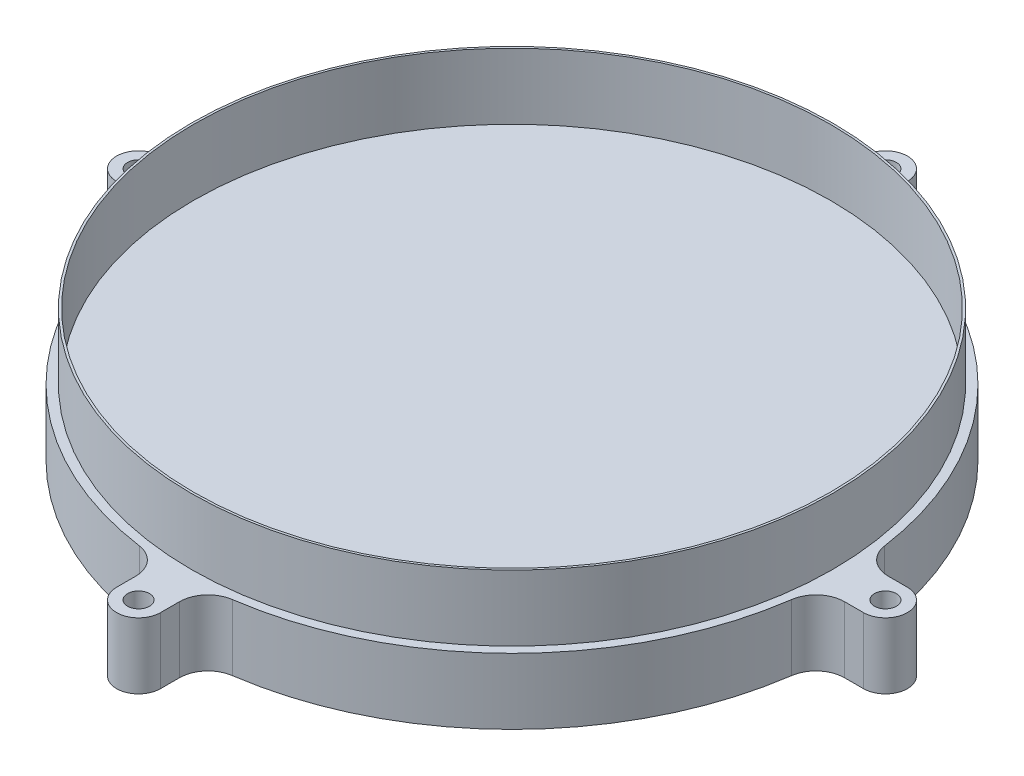
ISO-10303-21;
HEADER;
FILE_DESCRIPTION(('STEP AP214'),'2;1');
FILE_NAME('part.step','',(''),(''),'','','');
FILE_SCHEMA(('AUTOMOTIVE_DESIGN { 1 0 10303 214 1 1 1 1 }'));
ENDSEC;
DATA;
#1=APPLICATION_CONTEXT('core data for automotive mechanical design processes');
#2=APPLICATION_PROTOCOL_DEFINITION('international standard','automotive_design',2000,#1);
#3=PRODUCT_CONTEXT('',#1,'mechanical');
#4=PRODUCT('Part','Part','',(#3));
#5=PRODUCT_RELATED_PRODUCT_CATEGORY('part','',(#4));
#6=PRODUCT_DEFINITION_FORMATION('','',#4);
#7=PRODUCT_DEFINITION_CONTEXT('part definition',#1,'design');
#8=PRODUCT_DEFINITION('design','',#6,#7);
#9=PRODUCT_DEFINITION_SHAPE('','',#8);
#10=(LENGTH_UNIT() NAMED_UNIT(*) SI_UNIT(.MILLI.,.METRE.));
#11=(NAMED_UNIT(*) PLANE_ANGLE_UNIT() SI_UNIT($,.RADIAN.));
#12=(NAMED_UNIT(*) SI_UNIT($,.STERADIAN.) SOLID_ANGLE_UNIT());
#13=UNCERTAINTY_MEASURE_WITH_UNIT(LENGTH_MEASURE(1.E-05),#10,'distance_accuracy_value','');
#14=(GEOMETRIC_REPRESENTATION_CONTEXT(3) GLOBAL_UNCERTAINTY_ASSIGNED_CONTEXT((#13)) GLOBAL_UNIT_ASSIGNED_CONTEXT((#10,
#11,#12)) REPRESENTATION_CONTEXT('',''));
#15=CARTESIAN_POINT('',(0.,0.,0.));
#16=DIRECTION('',(0.,0.,1.));
#17=DIRECTION('',(1.,0.,0.));
#18=AXIS2_PLACEMENT_3D('',#15,#16,#17);
#19=CARTESIAN_POINT('',(0.,30.,0.));
#20=DIRECTION('',(0.,1.,0.));
#21=DIRECTION('',(0.,0.,1.));
#22=AXIS2_PLACEMENT_3D('',#19,#20,#21);
#23=PLANE('',#22);
#24=CARTESIAN_POINT('',(0.,30.,0.));
#25=DIRECTION('',(0.,1.,0.));
#26=DIRECTION('',(0.,0.,1.));
#27=AXIS2_PLACEMENT_3D('',#24,#25,#26);
#28=CIRCLE('',#27,146.);
#29=CARTESIAN_POINT('',(0.,30.,146.));
#30=VERTEX_POINT('',#29);
#31=EDGE_CURVE('E12',#30,#30,#28,.T.);
#32=ORIENTED_EDGE('',*,*,#31,.T.);
#33=EDGE_LOOP('',(#32));
#34=FACE_BOUND('',#33,.T.);
#35=CARTESIAN_POINT('',(0.,30.,0.));
#36=DIRECTION('',(0.,1.,0.));
#37=DIRECTION('',(0.,0.,1.));
#38=AXIS2_PLACEMENT_3D('',#35,#36,#37);
#39=CIRCLE('',#38,145.);
#40=CARTESIAN_POINT('',(0.,30.,145.));
#41=VERTEX_POINT('',#40);
#42=EDGE_CURVE('E50',#41,#41,#39,.T.);
#43=ORIENTED_EDGE('',*,*,#42,.F.);
#44=EDGE_LOOP('',(#43));
#45=FACE_BOUND('',#44,.T.);
#46=ADVANCED_FACE('F41',(#34,#45),#23,.T.);
#47=CARTESIAN_POINT('',(0.,30.,0.));
#48=DIRECTION('',(0.,-1.,0.));
#49=DIRECTION('',(0.,0.,-1.));
#50=AXIS2_PLACEMENT_3D('',#47,#48,#49);
#51=CYLINDRICAL_SURFACE('',#50,146.);
#52=ORIENTED_EDGE('',*,*,#31,.F.);
#53=EDGE_LOOP('',(#52));
#54=FACE_BOUND('',#53,.T.);
#55=CARTESIAN_POINT('',(0.,0.,0.));
#56=DIRECTION('',(0.,-1.,0.));
#57=DIRECTION('',(0.,0.,-1.));
#58=AXIS2_PLACEMENT_3D('',#55,#56,#57);
#59=CIRCLE('',#58,146.);
#60=CARTESIAN_POINT('',(0.,0.,-146.));
#61=VERTEX_POINT('',#60);
#62=EDGE_CURVE('E309',#61,#61,#59,.T.);
#63=ORIENTED_EDGE('',*,*,#62,.F.);
#64=EDGE_LOOP('',(#63));
#65=FACE_BOUND('',#64,.T.);
#66=ADVANCED_FACE('F43',(#54,#65),#51,.T.);
#67=CARTESIAN_POINT('',(0.,30.,0.));
#68=DIRECTION('',(0.,-1.,0.));
#69=DIRECTION('',(0.,0.,-1.));
#70=AXIS2_PLACEMENT_3D('',#67,#68,#69);
#71=CYLINDRICAL_SURFACE('',#70,145.);
#72=ORIENTED_EDGE('',*,*,#42,.T.);
#73=EDGE_LOOP('',(#72));
#74=FACE_BOUND('',#73,.T.);
#75=CARTESIAN_POINT('',(0.,0.,0.));
#76=DIRECTION('',(0.,1.,0.));
#77=DIRECTION('',(0.,0.,1.));
#78=AXIS2_PLACEMENT_3D('',#75,#76,#77);
#79=CIRCLE('',#78,145.);
#80=CARTESIAN_POINT('',(0.,0.,145.));
#81=VERTEX_POINT('',#80);
#82=EDGE_CURVE('E353',#81,#81,#79,.T.);
#83=ORIENTED_EDGE('',*,*,#82,.F.);
#84=EDGE_LOOP('',(#83));
#85=FACE_BOUND('',#84,.T.);
#86=ADVANCED_FACE('F360',(#74,#85),#71,.F.);
#87=CARTESIAN_POINT('',(0.,0.,-170.000000000026));
#88=DIRECTION('',(0.,-1.,0.));
#89=DIRECTION('',(0.,0.,-1.));
#90=AXIS2_PLACEMENT_3D('',#87,#88,#89);
#91=PLANE('',#90);
#92=ORIENTED_EDGE('',*,*,#82,.T.);
#93=EDGE_LOOP('',(#92));
#94=FACE_BOUND('',#93,.T.);
#95=ADVANCED_FACE('F358',(#94),#91,.F.);
#96=CARTESIAN_POINT('',(0.,-30.,-170.000000000026));
#97=DIRECTION('',(0.,1.,0.));
#98=DIRECTION('',(0.,0.,1.));
#99=AXIS2_PLACEMENT_3D('',#96,#97,#98);
#100=CYLINDRICAL_SURFACE('',#99,9.99999999999653);
#101=CARTESIAN_POINT('',(0.,0.,-170.000000000026));
#102=DIRECTION('',(0.,1.,0.));
#103=DIRECTION('',(0.,0.,-1.));
#104=AXIS2_PLACEMENT_3D('',#101,#102,#103);
#105=CIRCLE('',#104,9.99999999999653);
#106=CARTESIAN_POINT('',(9.9999999999965,0.,-170.000000000026));
#107=VERTEX_POINT('',#106);
#108=CARTESIAN_POINT('',(-9.99999999999657,0.,-170.000000000027));
#109=VERTEX_POINT('',#108);
#110=EDGE_CURVE('E237',#107,#109,#105,.T.);
#111=ORIENTED_EDGE('',*,*,#110,.F.);
#112=DIRECTION('',(0.,1.,0.));
#113=VECTOR('',#112,1.);
#114=CARTESIAN_POINT('',(9.9999999999965,-30.,-170.000000000026));
#115=LINE('',#114,#113);
#116=CARTESIAN_POINT('',(9.9999999999965,-30.,-170.000000000026));
#117=VERTEX_POINT('',#116);
#118=EDGE_CURVE('E58',#117,#107,#115,.T.);
#119=ORIENTED_EDGE('',*,*,#118,.F.);
#120=CARTESIAN_POINT('',(0.,-30.,-170.000000000026));
#121=DIRECTION('',(0.,1.,0.));
#122=DIRECTION('',(0.,0.,-1.));
#123=AXIS2_PLACEMENT_3D('',#120,#121,#122);
#124=CIRCLE('',#123,9.99999999999653);
#125=CARTESIAN_POINT('',(-9.99999999999657,-30.,-170.000000000027));
#126=VERTEX_POINT('',#125);
#127=EDGE_CURVE('E307',#117,#126,#124,.T.);
#128=ORIENTED_EDGE('',*,*,#127,.T.);
#129=DIRECTION('',(0.,1.,0.));
#130=VECTOR('',#129,1.);
#131=CARTESIAN_POINT('',(-9.99999999999657,-30.,-170.000000000027));
#132=LINE('',#131,#130);
#133=EDGE_CURVE('E147',#126,#109,#132,.T.);
#134=ORIENTED_EDGE('',*,*,#133,.T.);
#135=EDGE_LOOP('',(#111,#119,#128,#134));
#136=FACE_BOUND('',#135,.T.);
#137=ADVANCED_FACE('F368',(#136),#100,.T.);
#138=CARTESIAN_POINT('',(9.99999999999309,-30.,-161.369142031555));
#139=DIRECTION('',(1.,0.,3.94746028641002E-13));
#140=DIRECTION('',(3.94746028641002E-13,0.,-1.));
#141=AXIS2_PLACEMENT_3D('',#138,#139,#140);
#142=PLANE('',#141);
#143=DIRECTION('',(3.94746028641002E-13,0.,-1.));
#144=VECTOR('',#143,1.);
#145=CARTESIAN_POINT('',(9.99999999999309,0.,-161.369142031555));
#146=LINE('',#145,#144);
#147=CARTESIAN_POINT('',(9.99999999999307,0.,-161.369142031555));
#148=VERTEX_POINT('',#147);
#149=EDGE_CURVE('E304',#148,#107,#146,.T.);
#150=ORIENTED_EDGE('',*,*,#149,.F.);
#151=DIRECTION('',(0.,1.,0.));
#152=VECTOR('',#151,1.);
#153=CARTESIAN_POINT('',(9.99999999999307,-30.,-161.369142031555));
#154=LINE('',#153,#152);
#155=CARTESIAN_POINT('',(9.99999999999307,-30.,-161.369142031555));
#156=VERTEX_POINT('',#155);
#157=EDGE_CURVE('E135',#156,#148,#154,.T.);
#158=ORIENTED_EDGE('',*,*,#157,.F.);
#159=DIRECTION('',(3.94746028641002E-13,0.,-1.));
#160=VECTOR('',#159,1.);
#161=CARTESIAN_POINT('',(9.99999999999309,-30.,-161.369142031555));
#162=LINE('',#161,#160);
#163=EDGE_CURVE('E227',#156,#117,#162,.T.);
#164=ORIENTED_EDGE('',*,*,#163,.T.);
#165=ORIENTED_EDGE('',*,*,#118,.T.);
#166=EDGE_LOOP('',(#150,#158,#164,#165));
#167=FACE_BOUND('',#166,.T.);
#168=ADVANCED_FACE('F508',(#167),#142,.T.);
#169=CARTESIAN_POINT('',(22.9999999999927,-30.,-161.369142031555));
#170=DIRECTION('',(0.,1.,0.));
#171=DIRECTION('',(0.,0.,1.));
#172=AXIS2_PLACEMENT_3D('',#169,#170,#171);
#173=CYLINDRICAL_SURFACE('',#172,12.9999999999997);
#174=CARTESIAN_POINT('',(22.9999999999927,0.,-161.369142031555));
#175=DIRECTION('',(0.,-1.,0.));
#176=DIRECTION('',(0.,0.,1.));
#177=AXIS2_PLACEMENT_3D('',#174,#175,#176);
#178=CIRCLE('',#177,12.9999999999997);
#179=CARTESIAN_POINT('',(21.1656441717725,0.,-148.499210458487));
#180=VERTEX_POINT('',#179);
#181=EDGE_CURVE('E214',#180,#148,#178,.T.);
#182=ORIENTED_EDGE('',*,*,#181,.F.);
#183=DIRECTION('',(0.,1.,0.));
#184=VECTOR('',#183,1.);
#185=CARTESIAN_POINT('',(21.1656441717725,-30.,-148.499210458487));
#186=LINE('',#185,#184);
#187=CARTESIAN_POINT('',(21.1656441717725,-30.,-148.499210458487));
#188=VERTEX_POINT('',#187);
#189=EDGE_CURVE('E209',#188,#180,#186,.T.);
#190=ORIENTED_EDGE('',*,*,#189,.F.);
#191=CARTESIAN_POINT('',(22.9999999999927,-30.,-161.369142031555));
#192=DIRECTION('',(0.,-1.,0.));
#193=DIRECTION('',(0.,0.,1.));
#194=AXIS2_PLACEMENT_3D('',#191,#192,#193);
#195=CIRCLE('',#194,12.9999999999997);
#196=EDGE_CURVE('E212',#188,#156,#195,.T.);
#197=ORIENTED_EDGE('',*,*,#196,.T.);
#198=ORIENTED_EDGE('',*,*,#157,.T.);
#199=EDGE_LOOP('',(#182,#190,#197,#198));
#200=FACE_BOUND('',#199,.T.);
#201=ADVANCED_FACE('F211',(#200),#173,.F.);
#202=CARTESIAN_POINT('',(0.,-30.,0.));
#203=DIRECTION('',(0.,1.,0.));
#204=DIRECTION('',(0.,0.,1.));
#205=AXIS2_PLACEMENT_3D('',#202,#203,#204);
#206=CYLINDRICAL_SURFACE('',#205,150.);
#207=CARTESIAN_POINT('',(0.,0.,0.));
#208=DIRECTION('',(0.,1.,0.));
#209=DIRECTION('',(0.,0.,1.));
#210=AXIS2_PLACEMENT_3D('',#207,#208,#209);
#211=CIRCLE('',#210,150.);
#212=CARTESIAN_POINT('',(148.499210458486,0.,-21.1656441717758));
#213=VERTEX_POINT('',#212);
#214=EDGE_CURVE('E301',#213,#180,#211,.T.);
#215=ORIENTED_EDGE('',*,*,#214,.F.);
#216=DIRECTION('',(0.,1.,0.));
#217=VECTOR('',#216,1.);
#218=CARTESIAN_POINT('',(148.499210458486,-30.,-21.1656441717758));
#219=LINE('',#218,#217);
#220=CARTESIAN_POINT('',(148.499210458486,-30.,-21.1656441717758));
#221=VERTEX_POINT('',#220);
#222=EDGE_CURVE('E219',#221,#213,#219,.T.);
#223=ORIENTED_EDGE('',*,*,#222,.F.);
#224=CARTESIAN_POINT('',(0.,-30.,0.));
#225=DIRECTION('',(0.,1.,0.));
#226=DIRECTION('',(0.,0.,1.));
#227=AXIS2_PLACEMENT_3D('',#224,#225,#226);
#228=CIRCLE('',#227,150.);
#229=EDGE_CURVE('E225',#221,#188,#228,.T.);
#230=ORIENTED_EDGE('',*,*,#229,.T.);
#231=ORIENTED_EDGE('',*,*,#189,.T.);
#232=EDGE_LOOP('',(#215,#223,#230,#231));
#233=FACE_BOUND('',#232,.T.);
#234=ADVANCED_FACE('F229',(#233),#206,.T.);
#235=CARTESIAN_POINT('',(161.369142031555,-30.,-22.9999999999965));
#236=DIRECTION('',(0.,1.,0.));
#237=DIRECTION('',(0.,0.,1.));
#238=AXIS2_PLACEMENT_3D('',#235,#236,#237);
#239=CYLINDRICAL_SURFACE('',#238,12.9999999999999);
#240=CARTESIAN_POINT('',(161.369142031555,0.,-22.9999999999965));
#241=DIRECTION('',(0.,-1.,0.));
#242=DIRECTION('',(0.,0.,-1.));
#243=AXIS2_PLACEMENT_3D('',#240,#241,#242);
#244=CIRCLE('',#243,12.9999999999999);
#245=CARTESIAN_POINT('',(161.369142031555,0.,-9.99999999999658));
#246=VERTEX_POINT('',#245);
#247=EDGE_CURVE('E298',#246,#213,#244,.T.);
#248=ORIENTED_EDGE('',*,*,#247,.F.);
#249=DIRECTION('',(0.,1.,0.));
#250=VECTOR('',#249,1.);
#251=CARTESIAN_POINT('',(161.369142031555,-30.,-9.99999999999658));
#252=LINE('',#251,#250);
#253=CARTESIAN_POINT('',(161.369142031555,-30.,-9.99999999999658));
#254=VERTEX_POINT('',#253);
#255=EDGE_CURVE('E312',#254,#246,#252,.T.);
#256=ORIENTED_EDGE('',*,*,#255,.F.);
#257=CARTESIAN_POINT('',(161.369142031555,-30.,-22.9999999999965));
#258=DIRECTION('',(0.,-1.,0.));
#259=DIRECTION('',(0.,0.,-1.));
#260=AXIS2_PLACEMENT_3D('',#257,#258,#259);
#261=CIRCLE('',#260,12.9999999999999);
#262=EDGE_CURVE('E230',#254,#221,#261,.T.);
#263=ORIENTED_EDGE('',*,*,#262,.T.);
#264=ORIENTED_EDGE('',*,*,#222,.T.);
#265=EDGE_LOOP('',(#248,#256,#263,#264));
#266=FACE_BOUND('',#265,.T.);
#267=ADVANCED_FACE('F507',(#266),#239,.F.);
#268=CARTESIAN_POINT('',(161.369142031555,-30.,-9.99999999999658));
#269=DIRECTION('',(0.,0.,-1.));
#270=DIRECTION('',(-1.,0.,0.));
#271=AXIS2_PLACEMENT_3D('',#268,#269,#270);
#272=PLANE('',#271);
#273=DIRECTION('',(-1.,0.,0.));
#274=VECTOR('',#273,1.);
#275=CARTESIAN_POINT('',(161.369142031555,0.,-9.99999999999658));
#276=LINE('',#275,#274);
#277=CARTESIAN_POINT('',(170.000000000027,0.,-9.99999999999658));
#278=VERTEX_POINT('',#277);
#279=EDGE_CURVE('E295',#278,#246,#276,.T.);
#280=ORIENTED_EDGE('',*,*,#279,.F.);
#281=DIRECTION('',(0.,1.,0.));
#282=VECTOR('',#281,1.);
#283=CARTESIAN_POINT('',(170.000000000027,-30.,-9.99999999999658));
#284=LINE('',#283,#282);
#285=CARTESIAN_POINT('',(170.000000000027,-30.,-9.99999999999658));
#286=VERTEX_POINT('',#285);
#287=EDGE_CURVE('E314',#286,#278,#284,.T.);
#288=ORIENTED_EDGE('',*,*,#287,.F.);
#289=DIRECTION('',(-1.,0.,0.));
#290=VECTOR('',#289,1.);
#291=CARTESIAN_POINT('',(161.369142031555,-30.,-9.99999999999658));
#292=LINE('',#291,#290);
#293=EDGE_CURVE('E232',#286,#254,#292,.T.);
#294=ORIENTED_EDGE('',*,*,#293,.T.);
#295=ORIENTED_EDGE('',*,*,#255,.T.);
#296=EDGE_LOOP('',(#280,#288,#294,#295));
#297=FACE_BOUND('',#296,.T.);
#298=ADVANCED_FACE('F504',(#297),#272,.T.);
#299=CARTESIAN_POINT('',(170.000000000026,-30.,0.));
#300=DIRECTION('',(0.,1.,0.));
#301=DIRECTION('',(0.,0.,1.));
#302=AXIS2_PLACEMENT_3D('',#299,#300,#301);
#303=CYLINDRICAL_SURFACE('',#302,9.99999999999653);
#304=CARTESIAN_POINT('',(170.000000000026,0.,0.));
#305=DIRECTION('',(0.,1.,0.));
#306=DIRECTION('',(0.,0.,-1.));
#307=AXIS2_PLACEMENT_3D('',#304,#305,#306);
#308=CIRCLE('',#307,9.99999999999653);
#309=CARTESIAN_POINT('',(170.000000000026,0.,9.99999999999649));
#310=VERTEX_POINT('',#309);
#311=EDGE_CURVE('E292',#310,#278,#308,.T.);
#312=ORIENTED_EDGE('',*,*,#311,.F.);
#313=DIRECTION('',(0.,1.,0.));
#314=VECTOR('',#313,1.);
#315=CARTESIAN_POINT('',(170.000000000026,-30.,9.99999999999649));
#316=LINE('',#315,#314);
#317=CARTESIAN_POINT('',(170.000000000026,-30.,9.99999999999649));
#318=VERTEX_POINT('',#317);
#319=EDGE_CURVE('E316',#318,#310,#316,.T.);
#320=ORIENTED_EDGE('',*,*,#319,.F.);
#321=CARTESIAN_POINT('',(170.000000000026,-30.,0.));
#322=DIRECTION('',(0.,1.,0.));
#323=DIRECTION('',(0.,0.,-1.));
#324=AXIS2_PLACEMENT_3D('',#321,#322,#323);
#325=CIRCLE('',#324,9.99999999999653);
#326=EDGE_CURVE('E500',#318,#286,#325,.T.);
#327=ORIENTED_EDGE('',*,*,#326,.T.);
#328=ORIENTED_EDGE('',*,*,#287,.T.);
#329=EDGE_LOOP('',(#312,#320,#327,#328));
#330=FACE_BOUND('',#329,.T.);
#331=ADVANCED_FACE('F497',(#330),#303,.T.);
#332=CARTESIAN_POINT('',(161.369142031555,-30.,9.99999999999649));
#333=DIRECTION('',(0.,0.,1.));
#334=DIRECTION('',(1.,0.,0.));
#335=AXIS2_PLACEMENT_3D('',#332,#333,#334);
#336=PLANE('',#335);
#337=DIRECTION('',(1.,0.,0.));
#338=VECTOR('',#337,1.);
#339=CARTESIAN_POINT('',(161.369142031555,0.,9.99999999999649));
#340=LINE('',#339,#338);
#341=CARTESIAN_POINT('',(161.369142031555,0.,9.99999999999652));
#342=VERTEX_POINT('',#341);
#343=EDGE_CURVE('E289',#342,#310,#340,.T.);
#344=ORIENTED_EDGE('',*,*,#343,.F.);
#345=DIRECTION('',(0.,1.,0.));
#346=VECTOR('',#345,1.);
#347=CARTESIAN_POINT('',(161.369142031555,-30.,9.99999999999652));
#348=LINE('',#347,#346);
#349=CARTESIAN_POINT('',(161.369142031555,-30.,9.99999999999652));
#350=VERTEX_POINT('',#349);
#351=EDGE_CURVE('E318',#350,#342,#348,.T.);
#352=ORIENTED_EDGE('',*,*,#351,.F.);
#353=DIRECTION('',(1.,0.,0.));
#354=VECTOR('',#353,1.);
#355=CARTESIAN_POINT('',(161.369142031555,-30.,9.99999999999649));
#356=LINE('',#355,#354);
#357=EDGE_CURVE('E623',#350,#318,#356,.T.);
#358=ORIENTED_EDGE('',*,*,#357,.T.);
#359=ORIENTED_EDGE('',*,*,#319,.T.);
#360=EDGE_LOOP('',(#344,#352,#358,#359));
#361=FACE_BOUND('',#360,.T.);
#362=ADVANCED_FACE('F493',(#361),#336,.T.);
#363=CARTESIAN_POINT('',(161.369142031555,-30.,22.9999999999964));
#364=DIRECTION('',(0.,1.,0.));
#365=DIRECTION('',(0.,0.,1.));
#366=AXIS2_PLACEMENT_3D('',#363,#364,#365);
#367=CYLINDRICAL_SURFACE('',#366,12.9999999999998);
#368=CARTESIAN_POINT('',(161.369142031555,0.,22.9999999999964));
#369=DIRECTION('',(0.,-1.,0.));
#370=DIRECTION('',(0.,0.,1.));
#371=AXIS2_PLACEMENT_3D('',#368,#369,#370);
#372=CIRCLE('',#371,12.9999999999998);
#373=CARTESIAN_POINT('',(148.499210458486,0.,21.1656441717758));
#374=VERTEX_POINT('',#373);
#375=EDGE_CURVE('E286',#374,#342,#372,.T.);
#376=ORIENTED_EDGE('',*,*,#375,.F.);
#377=DIRECTION('',(0.,1.,0.));
#378=VECTOR('',#377,1.);
#379=CARTESIAN_POINT('',(148.499210458486,-30.,21.1656441717758));
#380=LINE('',#379,#378);
#381=CARTESIAN_POINT('',(148.499210458486,-30.,21.1656441717758));
#382=VERTEX_POINT('',#381);
#383=EDGE_CURVE('E320',#382,#374,#380,.T.);
#384=ORIENTED_EDGE('',*,*,#383,.F.);
#385=CARTESIAN_POINT('',(161.369142031555,-30.,22.9999999999964));
#386=DIRECTION('',(0.,-1.,0.));
#387=DIRECTION('',(0.,0.,1.));
#388=AXIS2_PLACEMENT_3D('',#385,#386,#387);
#389=CIRCLE('',#388,12.9999999999998);
#390=EDGE_CURVE('E489',#382,#350,#389,.T.);
#391=ORIENTED_EDGE('',*,*,#390,.T.);
#392=ORIENTED_EDGE('',*,*,#351,.T.);
#393=EDGE_LOOP('',(#376,#384,#391,#392));
#394=FACE_BOUND('',#393,.T.);
#395=ADVANCED_FACE('F487',(#394),#367,.F.);
#396=CARTESIAN_POINT('',(0.,-30.,0.));
#397=DIRECTION('',(0.,1.,0.));
#398=DIRECTION('',(0.,0.,1.));
#399=AXIS2_PLACEMENT_3D('',#396,#397,#398);
#400=CYLINDRICAL_SURFACE('',#399,150.);
#401=CARTESIAN_POINT('',(0.,0.,0.));
#402=DIRECTION('',(0.,1.,0.));
#403=DIRECTION('',(0.,0.,1.));
#404=AXIS2_PLACEMENT_3D('',#401,#402,#403);
#405=CIRCLE('',#404,150.);
#406=CARTESIAN_POINT('',(21.1656441717758,0.,148.499210458486));
#407=VERTEX_POINT('',#406);
#408=EDGE_CURVE('E283',#407,#374,#405,.T.);
#409=ORIENTED_EDGE('',*,*,#408,.F.);
#410=DIRECTION('',(0.,1.,0.));
#411=VECTOR('',#410,1.);
#412=CARTESIAN_POINT('',(21.1656441717758,-30.,148.499210458486));
#413=LINE('',#412,#411);
#414=CARTESIAN_POINT('',(21.1656441717758,-30.,148.499210458486));
#415=VERTEX_POINT('',#414);
#416=EDGE_CURVE('E322',#415,#407,#413,.T.);
#417=ORIENTED_EDGE('',*,*,#416,.F.);
#418=CARTESIAN_POINT('',(0.,-30.,0.));
#419=DIRECTION('',(0.,1.,0.));
#420=DIRECTION('',(0.,0.,1.));
#421=AXIS2_PLACEMENT_3D('',#418,#419,#420);
#422=CIRCLE('',#421,150.);
#423=EDGE_CURVE('E483',#415,#382,#422,.T.);
#424=ORIENTED_EDGE('',*,*,#423,.T.);
#425=ORIENTED_EDGE('',*,*,#383,.T.);
#426=EDGE_LOOP('',(#409,#417,#424,#425));
#427=FACE_BOUND('',#426,.T.);
#428=ADVANCED_FACE('F480',(#427),#400,.T.);
#429=CARTESIAN_POINT('',(22.9999999999964,-30.,161.369142031555));
#430=DIRECTION('',(0.,1.,0.));
#431=DIRECTION('',(0.,0.,1.));
#432=AXIS2_PLACEMENT_3D('',#429,#430,#431);
#433=CYLINDRICAL_SURFACE('',#432,12.9999999999998);
#434=CARTESIAN_POINT('',(22.9999999999964,0.,161.369142031555));
#435=DIRECTION('',(0.,-1.,0.));
#436=DIRECTION('',(0.,0.,-1.));
#437=AXIS2_PLACEMENT_3D('',#434,#435,#436);
#438=CIRCLE('',#437,12.9999999999998);
#439=CARTESIAN_POINT('',(9.99999999999659,0.,161.369142031555));
#440=VERTEX_POINT('',#439);
#441=EDGE_CURVE('E280',#440,#407,#438,.T.);
#442=ORIENTED_EDGE('',*,*,#441,.F.);
#443=DIRECTION('',(0.,1.,0.));
#444=VECTOR('',#443,1.);
#445=CARTESIAN_POINT('',(9.99999999999659,-30.,161.369142031555));
#446=LINE('',#445,#444);
#447=CARTESIAN_POINT('',(9.99999999999659,-30.,161.369142031555));
#448=VERTEX_POINT('',#447);
#449=EDGE_CURVE('E324',#448,#440,#446,.T.);
#450=ORIENTED_EDGE('',*,*,#449,.F.);
#451=CARTESIAN_POINT('',(22.9999999999964,-30.,161.369142031555));
#452=DIRECTION('',(0.,-1.,0.));
#453=DIRECTION('',(0.,0.,-1.));
#454=AXIS2_PLACEMENT_3D('',#451,#452,#453);
#455=CIRCLE('',#454,12.9999999999998);
#456=EDGE_CURVE('E619',#448,#415,#455,.T.);
#457=ORIENTED_EDGE('',*,*,#456,.T.);
#458=ORIENTED_EDGE('',*,*,#416,.T.);
#459=EDGE_LOOP('',(#442,#450,#457,#458));
#460=FACE_BOUND('',#459,.T.);
#461=ADVANCED_FACE('F476',(#460),#433,.F.);
#462=CARTESIAN_POINT('',(9.99999999999659,-30.,161.369142031555));
#463=DIRECTION('',(1.,0.,0.));
#464=DIRECTION('',(0.,0.,-1.));
#465=AXIS2_PLACEMENT_3D('',#462,#463,#464);
#466=PLANE('',#465);
#467=DIRECTION('',(0.,0.,-1.));
#468=VECTOR('',#467,1.);
#469=CARTESIAN_POINT('',(9.99999999999659,0.,161.369142031555));
#470=LINE('',#469,#468);
#471=CARTESIAN_POINT('',(9.99999999999659,0.,170.000000000027));
#472=VERTEX_POINT('',#471);
#473=EDGE_CURVE('E277',#472,#440,#470,.T.);
#474=ORIENTED_EDGE('',*,*,#473,.F.);
#475=DIRECTION('',(0.,1.,0.));
#476=VECTOR('',#475,1.);
#477=CARTESIAN_POINT('',(9.99999999999659,-30.,170.000000000027));
#478=LINE('',#477,#476);
#479=CARTESIAN_POINT('',(9.99999999999659,-30.,170.000000000027));
#480=VERTEX_POINT('',#479);
#481=EDGE_CURVE('E326',#480,#472,#478,.T.);
#482=ORIENTED_EDGE('',*,*,#481,.F.);
#483=DIRECTION('',(0.,0.,-1.));
#484=VECTOR('',#483,1.);
#485=CARTESIAN_POINT('',(9.99999999999659,-30.,161.369142031555));
#486=LINE('',#485,#484);
#487=EDGE_CURVE('E472',#480,#448,#486,.T.);
#488=ORIENTED_EDGE('',*,*,#487,.T.);
#489=ORIENTED_EDGE('',*,*,#449,.T.);
#490=EDGE_LOOP('',(#474,#482,#488,#489));
#491=FACE_BOUND('',#490,.T.);
#492=ADVANCED_FACE('F470',(#491),#466,.T.);
#493=CARTESIAN_POINT('',(0.,-30.,170.000000000026));
#494=DIRECTION('',(0.,1.,0.));
#495=DIRECTION('',(0.,0.,1.));
#496=AXIS2_PLACEMENT_3D('',#493,#494,#495);
#497=CYLINDRICAL_SURFACE('',#496,9.99999999999653);
#498=CARTESIAN_POINT('',(0.,0.,170.000000000026));
#499=DIRECTION('',(0.,1.,0.));
#500=DIRECTION('',(0.,0.,-1.));
#501=AXIS2_PLACEMENT_3D('',#498,#499,#500);
#502=CIRCLE('',#501,9.99999999999653);
#503=CARTESIAN_POINT('',(-9.99999999999648,0.,170.000000000026));
#504=VERTEX_POINT('',#503);
#505=EDGE_CURVE('E274',#504,#472,#502,.T.);
#506=ORIENTED_EDGE('',*,*,#505,.F.);
#507=DIRECTION('',(0.,1.,0.));
#508=VECTOR('',#507,1.);
#509=CARTESIAN_POINT('',(-9.99999999999648,-30.,170.000000000026));
#510=LINE('',#509,#508);
#511=CARTESIAN_POINT('',(-9.99999999999648,-30.,170.000000000026));
#512=VERTEX_POINT('',#511);
#513=EDGE_CURVE('E328',#512,#504,#510,.T.);
#514=ORIENTED_EDGE('',*,*,#513,.F.);
#515=CARTESIAN_POINT('',(0.,-30.,170.000000000026));
#516=DIRECTION('',(0.,1.,0.));
#517=DIRECTION('',(0.,0.,-1.));
#518=AXIS2_PLACEMENT_3D('',#515,#516,#517);
#519=CIRCLE('',#518,9.99999999999653);
#520=EDGE_CURVE('E466',#512,#480,#519,.T.);
#521=ORIENTED_EDGE('',*,*,#520,.T.);
#522=ORIENTED_EDGE('',*,*,#481,.T.);
#523=EDGE_LOOP('',(#506,#514,#521,#522));
#524=FACE_BOUND('',#523,.T.);
#525=ADVANCED_FACE('F463',(#524),#497,.T.);
#526=CARTESIAN_POINT('',(-9.99999999999648,-30.,161.369142031555));
#527=DIRECTION('',(-1.,0.,0.));
#528=DIRECTION('',(0.,0.,1.));
#529=AXIS2_PLACEMENT_3D('',#526,#527,#528);
#530=PLANE('',#529);
#531=DIRECTION('',(0.,0.,1.));
#532=VECTOR('',#531,1.);
#533=CARTESIAN_POINT('',(-9.99999999999648,0.,161.369142031555));
#534=LINE('',#533,#532);
#535=CARTESIAN_POINT('',(-9.99999999999651,0.,161.369142031555));
#536=VERTEX_POINT('',#535);
#537=EDGE_CURVE('E271',#536,#504,#534,.T.);
#538=ORIENTED_EDGE('',*,*,#537,.F.);
#539=DIRECTION('',(0.,1.,0.));
#540=VECTOR('',#539,1.);
#541=CARTESIAN_POINT('',(-9.99999999999651,-30.,161.369142031555));
#542=LINE('',#541,#540);
#543=CARTESIAN_POINT('',(-9.99999999999651,-30.,161.369142031555));
#544=VERTEX_POINT('',#543);
#545=EDGE_CURVE('E330',#544,#536,#542,.T.);
#546=ORIENTED_EDGE('',*,*,#545,.F.);
#547=DIRECTION('',(0.,0.,1.));
#548=VECTOR('',#547,1.);
#549=CARTESIAN_POINT('',(-9.99999999999648,-30.,161.369142031555));
#550=LINE('',#549,#548);
#551=EDGE_CURVE('E615',#544,#512,#550,.T.);
#552=ORIENTED_EDGE('',*,*,#551,.T.);
#553=ORIENTED_EDGE('',*,*,#513,.T.);
#554=EDGE_LOOP('',(#538,#546,#552,#553));
#555=FACE_BOUND('',#554,.T.);
#556=ADVANCED_FACE('F459',(#555),#530,.T.);
#557=CARTESIAN_POINT('',(-22.9999999999964,-30.,161.369142031555));
#558=DIRECTION('',(0.,1.,0.));
#559=DIRECTION('',(0.,0.,1.));
#560=AXIS2_PLACEMENT_3D('',#557,#558,#559);
#561=CYLINDRICAL_SURFACE('',#560,12.9999999999998);
#562=CARTESIAN_POINT('',(-22.9999999999964,0.,161.369142031555));
#563=DIRECTION('',(0.,-1.,0.));
#564=DIRECTION('',(0.,0.,1.));
#565=AXIS2_PLACEMENT_3D('',#562,#563,#564);
#566=CIRCLE('',#565,12.9999999999998);
#567=CARTESIAN_POINT('',(-21.1656441717758,0.,148.499210458486));
#568=VERTEX_POINT('',#567);
#569=EDGE_CURVE('E268',#568,#536,#566,.T.);
#570=ORIENTED_EDGE('',*,*,#569,.F.);
#571=DIRECTION('',(0.,1.,0.));
#572=VECTOR('',#571,1.);
#573=CARTESIAN_POINT('',(-21.1656441717758,-30.,148.499210458486));
#574=LINE('',#573,#572);
#575=CARTESIAN_POINT('',(-21.1656441717758,-30.,148.499210458486));
#576=VERTEX_POINT('',#575);
#577=EDGE_CURVE('E332',#576,#568,#574,.T.);
#578=ORIENTED_EDGE('',*,*,#577,.F.);
#579=CARTESIAN_POINT('',(-22.9999999999964,-30.,161.369142031555));
#580=DIRECTION('',(0.,-1.,0.));
#581=DIRECTION('',(0.,0.,1.));
#582=AXIS2_PLACEMENT_3D('',#579,#580,#581);
#583=CIRCLE('',#582,12.9999999999998);
#584=EDGE_CURVE('E455',#576,#544,#583,.T.);
#585=ORIENTED_EDGE('',*,*,#584,.T.);
#586=ORIENTED_EDGE('',*,*,#545,.T.);
#587=EDGE_LOOP('',(#570,#578,#585,#586));
#588=FACE_BOUND('',#587,.T.);
#589=ADVANCED_FACE('F453',(#588),#561,.F.);
#590=CARTESIAN_POINT('',(0.,-30.,0.));
#591=DIRECTION('',(0.,1.,0.));
#592=DIRECTION('',(0.,0.,1.));
#593=AXIS2_PLACEMENT_3D('',#590,#591,#592);
#594=CYLINDRICAL_SURFACE('',#593,150.);
#595=CARTESIAN_POINT('',(0.,0.,0.));
#596=DIRECTION('',(0.,1.,0.));
#597=DIRECTION('',(0.,0.,1.));
#598=AXIS2_PLACEMENT_3D('',#595,#596,#597);
#599=CIRCLE('',#598,150.);
#600=CARTESIAN_POINT('',(-148.499210458486,0.,21.1656441717759));
#601=VERTEX_POINT('',#600);
#602=EDGE_CURVE('E265',#601,#568,#599,.T.);
#603=ORIENTED_EDGE('',*,*,#602,.F.);
#604=DIRECTION('',(0.,1.,0.));
#605=VECTOR('',#604,1.);
#606=CARTESIAN_POINT('',(-148.499210458486,-30.,21.1656441717759));
#607=LINE('',#606,#605);
#608=CARTESIAN_POINT('',(-148.499210458486,-30.,21.1656441717759));
#609=VERTEX_POINT('',#608);
#610=EDGE_CURVE('E334',#609,#601,#607,.T.);
#611=ORIENTED_EDGE('',*,*,#610,.F.);
#612=CARTESIAN_POINT('',(0.,-30.,0.));
#613=DIRECTION('',(0.,1.,0.));
#614=DIRECTION('',(0.,0.,1.));
#615=AXIS2_PLACEMENT_3D('',#612,#613,#614);
#616=CIRCLE('',#615,150.);
#617=EDGE_CURVE('E449',#609,#576,#616,.T.);
#618=ORIENTED_EDGE('',*,*,#617,.T.);
#619=ORIENTED_EDGE('',*,*,#577,.T.);
#620=EDGE_LOOP('',(#603,#611,#618,#619));
#621=FACE_BOUND('',#620,.T.);
#622=ADVANCED_FACE('F446',(#621),#594,.T.);
#623=CARTESIAN_POINT('',(-161.369142031555,-30.,22.9999999999965));
#624=DIRECTION('',(0.,1.,0.));
#625=DIRECTION('',(0.,0.,1.));
#626=AXIS2_PLACEMENT_3D('',#623,#624,#625);
#627=CYLINDRICAL_SURFACE('',#626,12.9999999999999);
#628=CARTESIAN_POINT('',(-161.369142031555,0.,22.9999999999965));
#629=DIRECTION('',(0.,-1.,0.));
#630=DIRECTION('',(0.,0.,-1.));
#631=AXIS2_PLACEMENT_3D('',#628,#629,#630);
#632=CIRCLE('',#631,12.9999999999999);
#633=CARTESIAN_POINT('',(-161.369142031555,0.,9.9999999999966));
#634=VERTEX_POINT('',#633);
#635=EDGE_CURVE('E262',#634,#601,#632,.T.);
#636=ORIENTED_EDGE('',*,*,#635,.F.);
#637=DIRECTION('',(0.,1.,0.));
#638=VECTOR('',#637,1.);
#639=CARTESIAN_POINT('',(-161.369142031555,-30.,9.9999999999966));
#640=LINE('',#639,#638);
#641=CARTESIAN_POINT('',(-161.369142031555,-30.,9.9999999999966));
#642=VERTEX_POINT('',#641);
#643=EDGE_CURVE('E336',#642,#634,#640,.T.);
#644=ORIENTED_EDGE('',*,*,#643,.F.);
#645=CARTESIAN_POINT('',(-161.369142031555,-30.,22.9999999999965));
#646=DIRECTION('',(0.,-1.,0.));
#647=DIRECTION('',(0.,0.,-1.));
#648=AXIS2_PLACEMENT_3D('',#645,#646,#647);
#649=CIRCLE('',#648,12.9999999999999);
#650=EDGE_CURVE('E611',#642,#609,#649,.T.);
#651=ORIENTED_EDGE('',*,*,#650,.T.);
#652=ORIENTED_EDGE('',*,*,#610,.T.);
#653=EDGE_LOOP('',(#636,#644,#651,#652));
#654=FACE_BOUND('',#653,.T.);
#655=ADVANCED_FACE('F442',(#654),#627,.F.);
#656=CARTESIAN_POINT('',(-161.369142031555,-30.,9.9999999999966));
#657=DIRECTION('',(0.,0.,1.));
#658=DIRECTION('',(1.,0.,0.));
#659=AXIS2_PLACEMENT_3D('',#656,#657,#658);
#660=PLANE('',#659);
#661=DIRECTION('',(1.,0.,0.));
#662=VECTOR('',#661,1.);
#663=CARTESIAN_POINT('',(-161.369142031555,0.,9.9999999999966));
#664=LINE('',#663,#662);
#665=CARTESIAN_POINT('',(-170.000000000027,0.,9.9999999999966));
#666=VERTEX_POINT('',#665);
#667=EDGE_CURVE('E259',#666,#634,#664,.T.);
#668=ORIENTED_EDGE('',*,*,#667,.F.);
#669=DIRECTION('',(0.,1.,0.));
#670=VECTOR('',#669,1.);
#671=CARTESIAN_POINT('',(-170.000000000027,-30.,9.9999999999966));
#672=LINE('',#671,#670);
#673=CARTESIAN_POINT('',(-170.000000000027,-30.,9.9999999999966));
#674=VERTEX_POINT('',#673);
#675=EDGE_CURVE('E338',#674,#666,#672,.T.);
#676=ORIENTED_EDGE('',*,*,#675,.F.);
#677=DIRECTION('',(1.,0.,0.));
#678=VECTOR('',#677,1.);
#679=CARTESIAN_POINT('',(-161.369142031555,-30.,9.9999999999966));
#680=LINE('',#679,#678);
#681=EDGE_CURVE('E438',#674,#642,#680,.T.);
#682=ORIENTED_EDGE('',*,*,#681,.T.);
#683=ORIENTED_EDGE('',*,*,#643,.T.);
#684=EDGE_LOOP('',(#668,#676,#682,#683));
#685=FACE_BOUND('',#684,.T.);
#686=ADVANCED_FACE('F436',(#685),#660,.T.);
#687=CARTESIAN_POINT('',(-170.000000000026,-30.,0.));
#688=DIRECTION('',(0.,1.,0.));
#689=DIRECTION('',(0.,0.,1.));
#690=AXIS2_PLACEMENT_3D('',#687,#688,#689);
#691=CYLINDRICAL_SURFACE('',#690,9.99999999999653);
#692=CARTESIAN_POINT('',(-170.000000000026,0.,0.));
#693=DIRECTION('',(0.,1.,0.));
#694=DIRECTION('',(0.,0.,-1.));
#695=AXIS2_PLACEMENT_3D('',#692,#693,#694);
#696=CIRCLE('',#695,9.99999999999653);
#697=CARTESIAN_POINT('',(-170.000000000026,0.,-9.99999999999647));
#698=VERTEX_POINT('',#697);
#699=EDGE_CURVE('E256',#698,#666,#696,.T.);
#700=ORIENTED_EDGE('',*,*,#699,.F.);
#701=DIRECTION('',(0.,1.,0.));
#702=VECTOR('',#701,1.);
#703=CARTESIAN_POINT('',(-170.000000000026,-30.,-9.99999999999647));
#704=LINE('',#703,#702);
#705=CARTESIAN_POINT('',(-170.000000000026,-30.,-9.99999999999647));
#706=VERTEX_POINT('',#705);
#707=EDGE_CURVE('E340',#706,#698,#704,.T.);
#708=ORIENTED_EDGE('',*,*,#707,.F.);
#709=CARTESIAN_POINT('',(-170.000000000026,-30.,0.));
#710=DIRECTION('',(0.,1.,0.));
#711=DIRECTION('',(0.,0.,-1.));
#712=AXIS2_PLACEMENT_3D('',#709,#710,#711);
#713=CIRCLE('',#712,9.99999999999653);
#714=EDGE_CURVE('E432',#706,#674,#713,.T.);
#715=ORIENTED_EDGE('',*,*,#714,.T.);
#716=ORIENTED_EDGE('',*,*,#675,.T.);
#717=EDGE_LOOP('',(#700,#708,#715,#716));
#718=FACE_BOUND('',#717,.T.);
#719=ADVANCED_FACE('F429',(#718),#691,.T.);
#720=CARTESIAN_POINT('',(-161.369142031555,-30.,-9.99999999999647));
#721=DIRECTION('',(0.,0.,-1.));
#722=DIRECTION('',(-1.,0.,0.));
#723=AXIS2_PLACEMENT_3D('',#720,#721,#722);
#724=PLANE('',#723);
#725=DIRECTION('',(-1.,0.,0.));
#726=VECTOR('',#725,1.);
#727=CARTESIAN_POINT('',(-161.369142031555,0.,-9.99999999999647));
#728=LINE('',#727,#726);
#729=CARTESIAN_POINT('',(-161.369142031555,0.,-9.9999999999965));
#730=VERTEX_POINT('',#729);
#731=EDGE_CURVE('E253',#730,#698,#728,.T.);
#732=ORIENTED_EDGE('',*,*,#731,.F.);
#733=DIRECTION('',(0.,1.,0.));
#734=VECTOR('',#733,1.);
#735=CARTESIAN_POINT('',(-161.369142031555,-30.,-9.9999999999965));
#736=LINE('',#735,#734);
#737=CARTESIAN_POINT('',(-161.369142031555,-30.,-9.9999999999965));
#738=VERTEX_POINT('',#737);
#739=EDGE_CURVE('E342',#738,#730,#736,.T.);
#740=ORIENTED_EDGE('',*,*,#739,.F.);
#741=DIRECTION('',(-1.,0.,0.));
#742=VECTOR('',#741,1.);
#743=CARTESIAN_POINT('',(-161.369142031555,-30.,-9.99999999999647));
#744=LINE('',#743,#742);
#745=EDGE_CURVE('E607',#738,#706,#744,.T.);
#746=ORIENTED_EDGE('',*,*,#745,.T.);
#747=ORIENTED_EDGE('',*,*,#707,.T.);
#748=EDGE_LOOP('',(#732,#740,#746,#747));
#749=FACE_BOUND('',#748,.T.);
#750=ADVANCED_FACE('F425',(#749),#724,.T.);
#751=CARTESIAN_POINT('',(-161.369142031555,-30.,-22.9999999999963));
#752=DIRECTION('',(0.,1.,0.));
#753=DIRECTION('',(0.,0.,1.));
#754=AXIS2_PLACEMENT_3D('',#751,#752,#753);
#755=CYLINDRICAL_SURFACE('',#754,12.9999999999998);
#756=CARTESIAN_POINT('',(-161.369142031555,0.,-22.9999999999963));
#757=DIRECTION('',(0.,-1.,0.));
#758=DIRECTION('',(0.,0.,1.));
#759=AXIS2_PLACEMENT_3D('',#756,#757,#758);
#760=CIRCLE('',#759,12.9999999999998);
#761=CARTESIAN_POINT('',(-148.499210458486,0.,-21.1656441717758));
#762=VERTEX_POINT('',#761);
#763=EDGE_CURVE('E250',#762,#730,#760,.T.);
#764=ORIENTED_EDGE('',*,*,#763,.F.);
#765=DIRECTION('',(0.,1.,0.));
#766=VECTOR('',#765,1.);
#767=CARTESIAN_POINT('',(-148.499210458486,-30.,-21.1656441717758));
#768=LINE('',#767,#766);
#769=CARTESIAN_POINT('',(-148.499210458486,-30.,-21.1656441717758));
#770=VERTEX_POINT('',#769);
#771=EDGE_CURVE('E344',#770,#762,#768,.T.);
#772=ORIENTED_EDGE('',*,*,#771,.F.);
#773=CARTESIAN_POINT('',(-161.369142031555,-30.,-22.9999999999963));
#774=DIRECTION('',(0.,-1.,0.));
#775=DIRECTION('',(0.,0.,1.));
#776=AXIS2_PLACEMENT_3D('',#773,#774,#775);
#777=CIRCLE('',#776,12.9999999999998);
#778=EDGE_CURVE('E421',#770,#738,#777,.T.);
#779=ORIENTED_EDGE('',*,*,#778,.T.);
#780=ORIENTED_EDGE('',*,*,#739,.T.);
#781=EDGE_LOOP('',(#764,#772,#779,#780));
#782=FACE_BOUND('',#781,.T.);
#783=ADVANCED_FACE('F419',(#782),#755,.F.);
#784=CARTESIAN_POINT('',(0.,-30.,0.));
#785=DIRECTION('',(0.,1.,0.));
#786=DIRECTION('',(0.,0.,1.));
#787=AXIS2_PLACEMENT_3D('',#784,#785,#786);
#788=CYLINDRICAL_SURFACE('',#787,150.);
#789=CARTESIAN_POINT('',(0.,0.,0.));
#790=DIRECTION('',(0.,1.,0.));
#791=DIRECTION('',(0.,0.,1.));
#792=AXIS2_PLACEMENT_3D('',#789,#790,#791);
#793=CIRCLE('',#792,150.);
#794=CARTESIAN_POINT('',(-21.1656441717725,0.,-148.499210458487));
#795=VERTEX_POINT('',#794);
#796=EDGE_CURVE('E247',#795,#762,#793,.T.);
#797=ORIENTED_EDGE('',*,*,#796,.F.);
#798=DIRECTION('',(0.,1.,0.));
#799=VECTOR('',#798,1.);
#800=CARTESIAN_POINT('',(-21.1656441717725,-30.,-148.499210458487));
#801=LINE('',#800,#799);
#802=CARTESIAN_POINT('',(-21.1656441717725,-30.,-148.499210458487));
#803=VERTEX_POINT('',#802);
#804=EDGE_CURVE('E346',#803,#795,#801,.T.);
#805=ORIENTED_EDGE('',*,*,#804,.F.);
#806=CARTESIAN_POINT('',(0.,-30.,0.));
#807=DIRECTION('',(0.,1.,0.));
#808=DIRECTION('',(0.,0.,1.));
#809=AXIS2_PLACEMENT_3D('',#806,#807,#808);
#810=CIRCLE('',#809,150.);
#811=EDGE_CURVE('E415',#803,#770,#810,.T.);
#812=ORIENTED_EDGE('',*,*,#811,.T.);
#813=ORIENTED_EDGE('',*,*,#771,.T.);
#814=EDGE_LOOP('',(#797,#805,#812,#813));
#815=FACE_BOUND('',#814,.T.);
#816=ADVANCED_FACE('F412',(#815),#788,.T.);
#817=CARTESIAN_POINT('',(-22.9999999999927,-30.,-161.369142031555));
#818=DIRECTION('',(0.,1.,0.));
#819=DIRECTION('',(0.,0.,1.));
#820=AXIS2_PLACEMENT_3D('',#817,#818,#819);
#821=CYLINDRICAL_SURFACE('',#820,12.9999999999996);
#822=CARTESIAN_POINT('',(-22.9999999999927,0.,-161.369142031555));
#823=DIRECTION('',(0.,-1.,0.));
#824=DIRECTION('',(0.,0.,-1.));
#825=AXIS2_PLACEMENT_3D('',#822,#823,#824);
#826=CIRCLE('',#825,12.9999999999996);
#827=CARTESIAN_POINT('',(-9.99999999999314,0.,-161.369142031555));
#828=VERTEX_POINT('',#827);
#829=EDGE_CURVE('E244',#828,#795,#826,.T.);
#830=ORIENTED_EDGE('',*,*,#829,.F.);
#831=DIRECTION('',(0.,1.,0.));
#832=VECTOR('',#831,1.);
#833=CARTESIAN_POINT('',(-9.99999999999314,-30.,-161.369142031555));
#834=LINE('',#833,#832);
#835=CARTESIAN_POINT('',(-9.99999999999314,-30.,-161.369142031555));
#836=VERTEX_POINT('',#835);
#837=EDGE_CURVE('E348',#836,#828,#834,.T.);
#838=ORIENTED_EDGE('',*,*,#837,.F.);
#839=CARTESIAN_POINT('',(-22.9999999999927,-30.,-161.369142031555));
#840=DIRECTION('',(0.,-1.,0.));
#841=DIRECTION('',(0.,0.,-1.));
#842=AXIS2_PLACEMENT_3D('',#839,#840,#841);
#843=CIRCLE('',#842,12.9999999999996);
#844=EDGE_CURVE('E603',#836,#803,#843,.T.);
#845=ORIENTED_EDGE('',*,*,#844,.T.);
#846=ORIENTED_EDGE('',*,*,#804,.T.);
#847=EDGE_LOOP('',(#830,#838,#845,#846));
#848=FACE_BOUND('',#847,.T.);
#849=ADVANCED_FACE('F408',(#848),#821,.F.);
#850=CARTESIAN_POINT('',(-9.99999999999314,-30.,-161.369142031555));
#851=DIRECTION('',(-1.,0.,3.9675593713711E-13));
#852=DIRECTION('',(3.9675593713711E-13,0.,1.));
#853=AXIS2_PLACEMENT_3D('',#850,#851,#852);
#854=PLANE('',#853);
#855=DIRECTION('',(3.9675593713711E-13,0.,1.));
#856=VECTOR('',#855,1.);
#857=CARTESIAN_POINT('',(-9.99999999999314,0.,-161.369142031555));
#858=LINE('',#857,#856);
#859=EDGE_CURVE('E240',#109,#828,#858,.T.);
#860=ORIENTED_EDGE('',*,*,#859,.F.);
#861=ORIENTED_EDGE('',*,*,#133,.F.);
#862=DIRECTION('',(3.9675593713711E-13,0.,1.));
#863=VECTOR('',#862,1.);
#864=CARTESIAN_POINT('',(-9.99999999999314,-30.,-161.369142031555));
#865=LINE('',#864,#863);
#866=EDGE_CURVE('E404',#126,#836,#865,.T.);
#867=ORIENTED_EDGE('',*,*,#866,.T.);
#868=ORIENTED_EDGE('',*,*,#837,.T.);
#869=EDGE_LOOP('',(#860,#861,#867,#868));
#870=FACE_BOUND('',#869,.T.);
#871=ADVANCED_FACE('F402',(#870),#854,.T.);
#872=CARTESIAN_POINT('',(0.,-30.,-170.000000000026));
#873=DIRECTION('',(0.,-1.,0.));
#874=DIRECTION('',(0.,0.,-1.));
#875=AXIS2_PLACEMENT_3D('',#872,#873,#874);
#876=PLANE('',#875);
#877=CARTESIAN_POINT('',(-170.,-30.,0.));
#878=DIRECTION('',(0.,1.,0.));
#879=DIRECTION('',(0.,0.,1.));
#880=AXIS2_PLACEMENT_3D('',#877,#878,#879);
#881=CIRCLE('',#880,5.00000000000002);
#882=CARTESIAN_POINT('',(-170.,-30.,5.00000000000005));
#883=VERTEX_POINT('',#882);
#884=EDGE_CURVE('E586',#883,#883,#881,.T.);
#885=ORIENTED_EDGE('',*,*,#884,.T.);
#886=EDGE_LOOP('',(#885));
#887=FACE_BOUND('',#886,.T.);
#888=CARTESIAN_POINT('',(0.,-30.,170.));
#889=DIRECTION('',(0.,1.,0.));
#890=DIRECTION('',(0.,0.,1.));
#891=AXIS2_PLACEMENT_3D('',#888,#889,#890);
#892=CIRCLE('',#891,5.);
#893=CARTESIAN_POINT('',(0.,-30.,175.));
#894=VERTEX_POINT('',#893);
#895=EDGE_CURVE('E590',#894,#894,#892,.T.);
#896=ORIENTED_EDGE('',*,*,#895,.T.);
#897=EDGE_LOOP('',(#896));
#898=FACE_BOUND('',#897,.T.);
#899=CARTESIAN_POINT('',(170.,-30.,0.));
#900=DIRECTION('',(0.,1.,0.));
#901=DIRECTION('',(0.,0.,1.));
#902=AXIS2_PLACEMENT_3D('',#899,#900,#901);
#903=CIRCLE('',#902,5.00000000000002);
#904=CARTESIAN_POINT('',(170.,-30.,5.00000000000001));
#905=VERTEX_POINT('',#904);
#906=EDGE_CURVE('E594',#905,#905,#903,.T.);
#907=ORIENTED_EDGE('',*,*,#906,.T.);
#908=EDGE_LOOP('',(#907));
#909=FACE_BOUND('',#908,.T.);
#910=CARTESIAN_POINT('',(0.,-30.,-170.));
#911=DIRECTION('',(0.,1.,0.));
#912=DIRECTION('',(0.,0.,1.));
#913=AXIS2_PLACEMENT_3D('',#910,#911,#912);
#914=CIRCLE('',#913,5.);
#915=CARTESIAN_POINT('',(0.,-30.,-165.));
#916=VERTEX_POINT('',#915);
#917=EDGE_CURVE('E241',#916,#916,#914,.T.);
#918=ORIENTED_EDGE('',*,*,#917,.T.);
#919=EDGE_LOOP('',(#918));
#920=FACE_BOUND('',#919,.T.);
#921=ORIENTED_EDGE('',*,*,#127,.F.);
#922=ORIENTED_EDGE('',*,*,#163,.F.);
#923=ORIENTED_EDGE('',*,*,#196,.F.);
#924=ORIENTED_EDGE('',*,*,#229,.F.);
#925=ORIENTED_EDGE('',*,*,#262,.F.);
#926=ORIENTED_EDGE('',*,*,#293,.F.);
#927=ORIENTED_EDGE('',*,*,#326,.F.);
#928=ORIENTED_EDGE('',*,*,#357,.F.);
#929=ORIENTED_EDGE('',*,*,#390,.F.);
#930=ORIENTED_EDGE('',*,*,#423,.F.);
#931=ORIENTED_EDGE('',*,*,#456,.F.);
#932=ORIENTED_EDGE('',*,*,#487,.F.);
#933=ORIENTED_EDGE('',*,*,#520,.F.);
#934=ORIENTED_EDGE('',*,*,#551,.F.);
#935=ORIENTED_EDGE('',*,*,#584,.F.);
#936=ORIENTED_EDGE('',*,*,#617,.F.);
#937=ORIENTED_EDGE('',*,*,#650,.F.);
#938=ORIENTED_EDGE('',*,*,#681,.F.);
#939=ORIENTED_EDGE('',*,*,#714,.F.);
#940=ORIENTED_EDGE('',*,*,#745,.F.);
#941=ORIENTED_EDGE('',*,*,#778,.F.);
#942=ORIENTED_EDGE('',*,*,#811,.F.);
#943=ORIENTED_EDGE('',*,*,#844,.F.);
#944=ORIENTED_EDGE('',*,*,#866,.F.);
#945=EDGE_LOOP('',(#921,#922,#923,#924,#925,#926,#927,#928,#929,#930,#931,#932,#933,#934,#935,
#936,#937,#938,#939,#940,#941,#942,#943,#944));
#946=FACE_BOUND('',#945,.T.);
#947=ADVANCED_FACE('F223',(#887,#898,#909,#920,#946),#876,.T.);
#948=ORIENTED_EDGE('',*,*,#62,.T.);
#949=EDGE_LOOP('',(#948));
#950=FACE_BOUND('',#949,.T.);
#951=CARTESIAN_POINT('',(-170.,0.,0.));
#952=DIRECTION('',(0.,1.,0.));
#953=DIRECTION('',(0.,0.,1.));
#954=AXIS2_PLACEMENT_3D('',#951,#952,#953);
#955=CIRCLE('',#954,5.00000000000002);
#956=CARTESIAN_POINT('',(-170.,0.,5.00000000000005));
#957=VERTEX_POINT('',#956);
#958=EDGE_CURVE('E389',#957,#957,#955,.T.);
#959=ORIENTED_EDGE('',*,*,#958,.F.);
#960=EDGE_LOOP('',(#959));
#961=FACE_BOUND('',#960,.T.);
#962=CARTESIAN_POINT('',(0.,0.,170.));
#963=DIRECTION('',(0.,1.,0.));
#964=DIRECTION('',(0.,0.,1.));
#965=AXIS2_PLACEMENT_3D('',#962,#963,#964);
#966=CIRCLE('',#965,5.);
#967=CARTESIAN_POINT('',(0.,0.,175.));
#968=VERTEX_POINT('',#967);
#969=EDGE_CURVE('E393',#968,#968,#966,.T.);
#970=ORIENTED_EDGE('',*,*,#969,.F.);
#971=EDGE_LOOP('',(#970));
#972=FACE_BOUND('',#971,.T.);
#973=CARTESIAN_POINT('',(170.,0.,0.));
#974=DIRECTION('',(0.,1.,0.));
#975=DIRECTION('',(0.,0.,1.));
#976=AXIS2_PLACEMENT_3D('',#973,#974,#975);
#977=CIRCLE('',#976,5.00000000000002);
#978=CARTESIAN_POINT('',(170.,0.,5.00000000000001));
#979=VERTEX_POINT('',#978);
#980=EDGE_CURVE('E397',#979,#979,#977,.T.);
#981=ORIENTED_EDGE('',*,*,#980,.F.);
#982=EDGE_LOOP('',(#981));
#983=FACE_BOUND('',#982,.T.);
#984=CARTESIAN_POINT('',(0.,0.,-170.));
#985=DIRECTION('',(0.,1.,0.));
#986=DIRECTION('',(0.,0.,1.));
#987=AXIS2_PLACEMENT_3D('',#984,#985,#986);
#988=CIRCLE('',#987,5.);
#989=CARTESIAN_POINT('',(0.,0.,-165.));
#990=VERTEX_POINT('',#989);
#991=EDGE_CURVE('E401',#990,#990,#988,.T.);
#992=ORIENTED_EDGE('',*,*,#991,.F.);
#993=EDGE_LOOP('',(#992));
#994=FACE_BOUND('',#993,.T.);
#995=ORIENTED_EDGE('',*,*,#110,.T.);
#996=ORIENTED_EDGE('',*,*,#859,.T.);
#997=ORIENTED_EDGE('',*,*,#829,.T.);
#998=ORIENTED_EDGE('',*,*,#796,.T.);
#999=ORIENTED_EDGE('',*,*,#763,.T.);
#1000=ORIENTED_EDGE('',*,*,#731,.T.);
#1001=ORIENTED_EDGE('',*,*,#699,.T.);
#1002=ORIENTED_EDGE('',*,*,#667,.T.);
#1003=ORIENTED_EDGE('',*,*,#635,.T.);
#1004=ORIENTED_EDGE('',*,*,#602,.T.);
#1005=ORIENTED_EDGE('',*,*,#569,.T.);
#1006=ORIENTED_EDGE('',*,*,#537,.T.);
#1007=ORIENTED_EDGE('',*,*,#505,.T.);
#1008=ORIENTED_EDGE('',*,*,#473,.T.);
#1009=ORIENTED_EDGE('',*,*,#441,.T.);
#1010=ORIENTED_EDGE('',*,*,#408,.T.);
#1011=ORIENTED_EDGE('',*,*,#375,.T.);
#1012=ORIENTED_EDGE('',*,*,#343,.T.);
#1013=ORIENTED_EDGE('',*,*,#311,.T.);
#1014=ORIENTED_EDGE('',*,*,#279,.T.);
#1015=ORIENTED_EDGE('',*,*,#247,.T.);
#1016=ORIENTED_EDGE('',*,*,#214,.T.);
#1017=ORIENTED_EDGE('',*,*,#181,.T.);
#1018=ORIENTED_EDGE('',*,*,#149,.T.);
#1019=EDGE_LOOP('',(#995,#996,#997,#998,#999,#1000,#1001,#1002,#1003,#1004,#1005,#1006,#1007,
#1008,#1009,#1010,#1011,#1012,#1013,#1014,#1015,#1016,#1017,#1018));
#1020=FACE_BOUND('',#1019,.T.);
#1021=ADVANCED_FACE('F370',(#950,#961,#972,#983,#994,#1020),#91,.F.);
#1022=CARTESIAN_POINT('',(0.,-30.,-170.));
#1023=DIRECTION('',(0.,1.,0.));
#1024=DIRECTION('',(0.,0.,1.));
#1025=AXIS2_PLACEMENT_3D('',#1022,#1023,#1024);
#1026=CYLINDRICAL_SURFACE('',#1025,5.);
#1027=ORIENTED_EDGE('',*,*,#917,.F.);
#1028=EDGE_LOOP('',(#1027));
#1029=FACE_BOUND('',#1028,.T.);
#1030=ORIENTED_EDGE('',*,*,#991,.T.);
#1031=EDGE_LOOP('',(#1030));
#1032=FACE_BOUND('',#1031,.T.);
#1033=ADVANCED_FACE('F385',(#1029,#1032),#1026,.F.);
#1034=CARTESIAN_POINT('',(170.,-30.,0.));
#1035=DIRECTION('',(0.,1.,0.));
#1036=DIRECTION('',(0.,0.,1.));
#1037=AXIS2_PLACEMENT_3D('',#1034,#1035,#1036);
#1038=CYLINDRICAL_SURFACE('',#1037,5.00000000000002);
#1039=ORIENTED_EDGE('',*,*,#906,.F.);
#1040=EDGE_LOOP('',(#1039));
#1041=FACE_BOUND('',#1040,.T.);
#1042=ORIENTED_EDGE('',*,*,#980,.T.);
#1043=EDGE_LOOP('',(#1042));
#1044=FACE_BOUND('',#1043,.T.);
#1045=ADVANCED_FACE('F570',(#1041,#1044),#1038,.F.);
#1046=CARTESIAN_POINT('',(0.,-30.,170.));
#1047=DIRECTION('',(0.,1.,0.));
#1048=DIRECTION('',(0.,0.,1.));
#1049=AXIS2_PLACEMENT_3D('',#1046,#1047,#1048);
#1050=CYLINDRICAL_SURFACE('',#1049,5.);
#1051=ORIENTED_EDGE('',*,*,#895,.F.);
#1052=EDGE_LOOP('',(#1051));
#1053=FACE_BOUND('',#1052,.T.);
#1054=ORIENTED_EDGE('',*,*,#969,.T.);
#1055=EDGE_LOOP('',(#1054));
#1056=FACE_BOUND('',#1055,.T.);
#1057=ADVANCED_FACE('F574',(#1053,#1056),#1050,.F.);
#1058=CARTESIAN_POINT('',(-170.,-30.,0.));
#1059=DIRECTION('',(0.,1.,0.));
#1060=DIRECTION('',(0.,0.,1.));
#1061=AXIS2_PLACEMENT_3D('',#1058,#1059,#1060);
#1062=CYLINDRICAL_SURFACE('',#1061,5.00000000000002);
#1063=ORIENTED_EDGE('',*,*,#884,.F.);
#1064=EDGE_LOOP('',(#1063));
#1065=FACE_BOUND('',#1064,.T.);
#1066=ORIENTED_EDGE('',*,*,#958,.T.);
#1067=EDGE_LOOP('',(#1066));
#1068=FACE_BOUND('',#1067,.T.);
#1069=ADVANCED_FACE('F578',(#1065,#1068),#1062,.F.);
#1070=CLOSED_SHELL('',(#46,#66,#86,#95,#137,#168,#201,#234,#267,#298,#331,#362,#395,#428,#461,
#492,#525,#556,#589,#622,#655,#686,#719,#750,#783,#816,#849,#871,#947,#1021,#1033,#1045,#1057,#1069));
#1071=MANIFOLD_SOLID_BREP('B2',#1070);
#1072=ADVANCED_BREP_SHAPE_REPRESENTATION('',(#18,#1071),#14);
#1073=SHAPE_DEFINITION_REPRESENTATION(#9,#1072);
ENDSEC;
END-ISO-10303-21;
